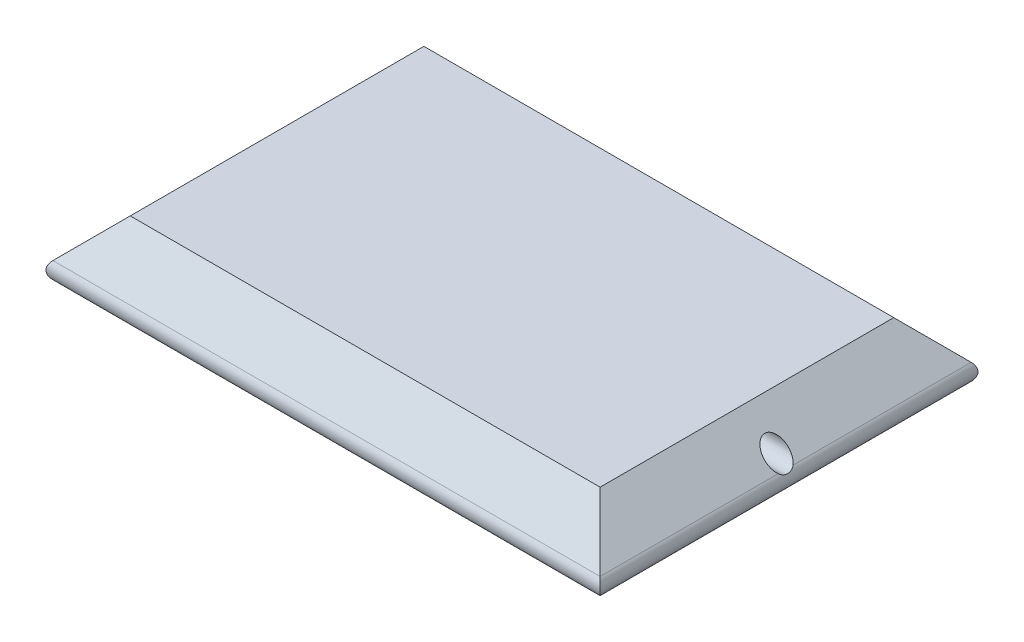
ISO-10303-21;
HEADER;
FILE_DESCRIPTION(('STEP AP214'),'2;1');
FILE_NAME('part.step','',(''),(''),'','','');
FILE_SCHEMA(('AUTOMOTIVE_DESIGN { 1 0 10303 214 1 1 1 1 }'));
ENDSEC;
DATA;
#1=APPLICATION_CONTEXT('core data for automotive mechanical design processes');
#2=APPLICATION_PROTOCOL_DEFINITION('international standard','automotive_design',2000,#1);
#3=PRODUCT_CONTEXT('',#1,'mechanical');
#4=PRODUCT('Part','Part','',(#3));
#5=PRODUCT_RELATED_PRODUCT_CATEGORY('part','',(#4));
#6=PRODUCT_DEFINITION_FORMATION('','',#4);
#7=PRODUCT_DEFINITION_CONTEXT('part definition',#1,'design');
#8=PRODUCT_DEFINITION('design','',#6,#7);
#9=PRODUCT_DEFINITION_SHAPE('','',#8);
#10=(LENGTH_UNIT() NAMED_UNIT(*) SI_UNIT(.MILLI.,.METRE.));
#11=(NAMED_UNIT(*) PLANE_ANGLE_UNIT() SI_UNIT($,.RADIAN.));
#12=(NAMED_UNIT(*) SI_UNIT($,.STERADIAN.) SOLID_ANGLE_UNIT());
#13=UNCERTAINTY_MEASURE_WITH_UNIT(LENGTH_MEASURE(1.E-05),#10,'distance_accuracy_value','');
#14=(GEOMETRIC_REPRESENTATION_CONTEXT(3) GLOBAL_UNCERTAINTY_ASSIGNED_CONTEXT((#13)) GLOBAL_UNIT_ASSIGNED_CONTEXT((#10,
#11,#12)) REPRESENTATION_CONTEXT('',''));
#15=CARTESIAN_POINT('',(0.,0.,0.));
#16=DIRECTION('',(0.,0.,1.));
#17=DIRECTION('',(1.,0.,0.));
#18=AXIS2_PLACEMENT_3D('',#15,#16,#17);
#19=CARTESIAN_POINT('',(50.,0.,-35.));
#20=DIRECTION('',(0.707106781186546,0.707106781186549,0.));
#21=DIRECTION('',(-0.707106781186549,0.707106781186546,0.));
#22=AXIS2_PLACEMENT_3D('',#19,#20,#21);
#23=PLANE('',#22);
#24=DIRECTION('',(0.577350269189627,-0.577350269189624,0.577350269189627));
#25=VECTOR('',#24,1.);
#26=CARTESIAN_POINT('',(26.6666666666666,23.3333333333333,11.6666666666666));
#27=LINE('',#26,#25);
#28=CARTESIAN_POINT('',(40.,10.,25.));
#29=VERTEX_POINT('',#28);
#30=CARTESIAN_POINT('',(46.5857864376269,3.4142135623731,31.5857864376269));
#31=VERTEX_POINT('',#30);
#32=EDGE_CURVE('E125',#29,#31,#27,.T.);
#33=ORIENTED_EDGE('',*,*,#32,.T.);
#34=DIRECTION('',(0.,0.,-1.));
#35=VECTOR('',#34,1.);
#36=CARTESIAN_POINT('',(46.5857864376269,3.4142135623731,-35.));
#37=LINE('',#36,#35);
#38=CARTESIAN_POINT('',(46.5857864376269,3.4142135623731,1.26719800951588));
#39=VERTEX_POINT('',#38);
#40=EDGE_CURVE('E44',#31,#39,#37,.T.);
#41=ORIENTED_EDGE('',*,*,#40,.T.);
#42=CARTESIAN_POINT('',(45.0384631990374,4.96153680096256,0.));
#43=DIRECTION('',(0.707106781186546,0.707106781186549,0.));
#44=DIRECTION('',(0.707106781186549,-0.707106781186546,0.));
#45=AXIS2_PLACEMENT_3D('',#42,#43,#44);
#46=ELLIPSE('',#45,2.8284271247462,2.);
#47=CARTESIAN_POINT('',(46.5857864376269,3.4142135623731,-1.26719800951589));
#48=VERTEX_POINT('',#47);
#49=EDGE_CURVE('E112',#39,#48,#46,.F.);
#50=ORIENTED_EDGE('',*,*,#49,.T.);
#51=DIRECTION('',(0.,0.,-1.));
#52=VECTOR('',#51,1.);
#53=CARTESIAN_POINT('',(46.5857864376269,3.4142135623731,-35.));
#54=LINE('',#53,#52);
#55=CARTESIAN_POINT('',(46.5857864376269,3.4142135623731,-31.5857864376269));
#56=VERTEX_POINT('',#55);
#57=EDGE_CURVE('E115',#48,#56,#54,.T.);
#58=ORIENTED_EDGE('',*,*,#57,.T.);
#59=DIRECTION('',(0.577350269189626,-0.577350269189624,-0.577350269189627));
#60=VECTOR('',#59,1.);
#61=CARTESIAN_POINT('',(16.6666666666666,33.3333333333333,-1.66666666666659));
#62=LINE('',#61,#60);
#63=CARTESIAN_POINT('',(40.,10.,-25.));
#64=VERTEX_POINT('',#63);
#65=EDGE_CURVE('E98',#64,#56,#62,.T.);
#66=ORIENTED_EDGE('',*,*,#65,.F.);
#67=DIRECTION('',(0.,0.,1.));
#68=VECTOR('',#67,1.);
#69=CARTESIAN_POINT('',(40.,10.,-35.));
#70=LINE('',#69,#68);
#71=EDGE_CURVE('E105',#29,#64,#70,.F.);
#72=ORIENTED_EDGE('',*,*,#71,.F.);
#73=EDGE_LOOP('',(#33,#41,#50,#58,#66,#72));
#74=FACE_BOUND('',#73,.T.);
#75=ADVANCED_FACE('F34',(#74),#23,.T.);
#76=CARTESIAN_POINT('',(-50.,0.,-35.));
#77=DIRECTION('',(0.,0.707106781186549,-0.707106781186546));
#78=DIRECTION('',(0.,0.707106781186546,0.707106781186549));
#79=AXIS2_PLACEMENT_3D('',#76,#77,#78);
#80=PLANE('',#79);
#81=ORIENTED_EDGE('',*,*,#65,.T.);
#82=DIRECTION('',(-1.,0.,0.));
#83=VECTOR('',#82,1.);
#84=CARTESIAN_POINT('',(-50.,3.41421356237309,-31.5857864376269));
#85=LINE('',#84,#83);
#86=CARTESIAN_POINT('',(-46.5857864376269,3.4142135623731,-31.5857864376269));
#87=VERTEX_POINT('',#86);
#88=EDGE_CURVE('E170',#56,#87,#85,.T.);
#89=ORIENTED_EDGE('',*,*,#88,.T.);
#90=DIRECTION('',(-0.577350269189627,-0.577350269189624,-0.577350269189627));
#91=VECTOR('',#90,1.);
#92=CARTESIAN_POINT('',(-50.,0.,-35.));
#93=LINE('',#92,#91);
#94=CARTESIAN_POINT('',(-40.,10.,-25.));
#95=VERTEX_POINT('',#94);
#96=EDGE_CURVE('E101',#95,#87,#93,.T.);
#97=ORIENTED_EDGE('',*,*,#96,.F.);
#98=DIRECTION('',(1.,0.,0.));
#99=VECTOR('',#98,1.);
#100=CARTESIAN_POINT('',(-50.,10.,-25.));
#101=LINE('',#100,#99);
#102=EDGE_CURVE('E94',#64,#95,#101,.F.);
#103=ORIENTED_EDGE('',*,*,#102,.F.);
#104=EDGE_LOOP('',(#81,#89,#97,#103));
#105=FACE_BOUND('',#104,.T.);
#106=ADVANCED_FACE('F96',(#105),#80,.T.);
#107=CARTESIAN_POINT('',(-50.,0.,-35.));
#108=DIRECTION('',(-0.707106781186546,0.707106781186549,0.));
#109=DIRECTION('',(-0.707106781186549,-0.707106781186546,0.));
#110=AXIS2_PLACEMENT_3D('',#107,#108,#109);
#111=PLANE('',#110);
#112=ORIENTED_EDGE('',*,*,#96,.T.);
#113=DIRECTION('',(0.,0.,1.));
#114=VECTOR('',#113,1.);
#115=CARTESIAN_POINT('',(-46.5857864376269,3.4142135623731,-35.));
#116=LINE('',#115,#114);
#117=CARTESIAN_POINT('',(-46.5857864376269,3.4142135623731,31.5857864376269));
#118=VERTEX_POINT('',#117);
#119=EDGE_CURVE('E116',#87,#118,#116,.T.);
#120=ORIENTED_EDGE('',*,*,#119,.T.);
#121=DIRECTION('',(-0.577350269189626,-0.577350269189624,0.577350269189627));
#122=VECTOR('',#121,1.);
#123=CARTESIAN_POINT('',(-50.,0.,35.));
#124=LINE('',#123,#122);
#125=CARTESIAN_POINT('',(-40.,10.,25.));
#126=VERTEX_POINT('',#125);
#127=EDGE_CURVE('E121',#126,#118,#124,.T.);
#128=ORIENTED_EDGE('',*,*,#127,.F.);
#129=DIRECTION('',(0.,0.,-1.));
#130=VECTOR('',#129,1.);
#131=CARTESIAN_POINT('',(-40.,10.,-35.));
#132=LINE('',#131,#130);
#133=EDGE_CURVE('E104',#95,#126,#132,.F.);
#134=ORIENTED_EDGE('',*,*,#133,.F.);
#135=EDGE_LOOP('',(#112,#120,#128,#134));
#136=FACE_BOUND('',#135,.T.);
#137=ADVANCED_FACE('F183',(#136),#111,.T.);
#138=CARTESIAN_POINT('',(-50.,0.,35.));
#139=DIRECTION('',(0.,0.707106781186549,0.707106781186546));
#140=DIRECTION('',(0.,-0.707106781186546,0.707106781186549));
#141=AXIS2_PLACEMENT_3D('',#138,#139,#140);
#142=PLANE('',#141);
#143=ORIENTED_EDGE('',*,*,#127,.T.);
#144=DIRECTION('',(1.,0.,0.));
#145=VECTOR('',#144,1.);
#146=CARTESIAN_POINT('',(-50.,3.41421356237309,31.5857864376269));
#147=LINE('',#146,#145);
#148=EDGE_CURVE('E180',#118,#31,#147,.T.);
#149=ORIENTED_EDGE('',*,*,#148,.T.);
#150=ORIENTED_EDGE('',*,*,#32,.F.);
#151=DIRECTION('',(-1.,0.,0.));
#152=VECTOR('',#151,1.);
#153=CARTESIAN_POINT('',(-50.,10.,25.));
#154=LINE('',#153,#152);
#155=EDGE_CURVE('E110',#126,#29,#154,.F.);
#156=ORIENTED_EDGE('',*,*,#155,.F.);
#157=EDGE_LOOP('',(#143,#149,#150,#156));
#158=FACE_BOUND('',#157,.T.);
#159=ADVANCED_FACE('F192',(#158),#142,.T.);
#160=CARTESIAN_POINT('',(50.,10.,35.));
#161=DIRECTION('',(0.,1.,0.));
#162=DIRECTION('',(0.,0.,1.));
#163=AXIS2_PLACEMENT_3D('',#160,#161,#162);
#164=PLANE('',#163);
#165=ORIENTED_EDGE('',*,*,#71,.T.);
#166=ORIENTED_EDGE('',*,*,#102,.T.);
#167=ORIENTED_EDGE('',*,*,#133,.T.);
#168=ORIENTED_EDGE('',*,*,#155,.T.);
#169=EDGE_LOOP('',(#165,#166,#167,#168));
#170=FACE_BOUND('',#169,.T.);
#171=ADVANCED_FACE('F108',(#170),#164,.T.);
#172=CARTESIAN_POINT('',(50.,0.,35.));
#173=DIRECTION('',(0.,1.,0.));
#174=DIRECTION('',(0.,0.,1.));
#175=AXIS2_PLACEMENT_3D('',#172,#173,#174);
#176=PLANE('',#175);
#177=DIRECTION('',(-1.,0.,0.));
#178=VECTOR('',#177,1.);
#179=CARTESIAN_POINT('',(50.,0.,30.1715728752538));
#180=LINE('',#179,#178);
#181=CARTESIAN_POINT('',(45.1715728752538,0.,30.1715728752538));
#182=VERTEX_POINT('',#181);
#183=CARTESIAN_POINT('',(-45.1715728752538,0.,30.1715728752538));
#184=VERTEX_POINT('',#183);
#185=EDGE_CURVE('E174',#182,#184,#180,.T.);
#186=ORIENTED_EDGE('',*,*,#185,.T.);
#187=DIRECTION('',(0.,0.,-1.));
#188=VECTOR('',#187,1.);
#189=CARTESIAN_POINT('',(-45.1715728752538,0.,35.));
#190=LINE('',#189,#188);
#191=CARTESIAN_POINT('',(-45.1715728752538,0.,-30.1715728752538));
#192=VERTEX_POINT('',#191);
#193=EDGE_CURVE('E178',#184,#192,#190,.T.);
#194=ORIENTED_EDGE('',*,*,#193,.T.);
#195=DIRECTION('',(1.,0.,0.));
#196=VECTOR('',#195,1.);
#197=CARTESIAN_POINT('',(50.,0.,-30.1715728752538));
#198=LINE('',#197,#196);
#199=CARTESIAN_POINT('',(45.1715728752538,0.,-30.1715728752538));
#200=VERTEX_POINT('',#199);
#201=EDGE_CURVE('E168',#192,#200,#198,.T.);
#202=ORIENTED_EDGE('',*,*,#201,.T.);
#203=DIRECTION('',(0.,0.,1.));
#204=VECTOR('',#203,1.);
#205=CARTESIAN_POINT('',(45.1715728752538,0.,35.));
#206=LINE('',#205,#204);
#207=EDGE_CURVE('E119',#200,#182,#206,.T.);
#208=ORIENTED_EDGE('',*,*,#207,.T.);
#209=EDGE_LOOP('',(#186,#194,#202,#208));
#210=FACE_BOUND('',#209,.T.);
#211=ADVANCED_FACE('F144',(#210),#176,.F.);
#212=CARTESIAN_POINT('',(54.7999003943573,4.96153680096256,0.));
#213=DIRECTION('',(1.,0.,0.));
#214=DIRECTION('',(0.,0.,-1.));
#215=AXIS2_PLACEMENT_3D('',#212,#213,#214);
#216=CYLINDRICAL_SURFACE('',#215,2.);
#217=CARTESIAN_POINT('',(28.9336134010088,3.57052206354669,-1.43703792583629));
#218=CARTESIAN_POINT('',(28.9302500842993,3.65129543883444,-1.51521745408679));
#219=CARTESIAN_POINT('',(28.9266046364787,3.73872841691853,-1.58662283919386));
#220=CARTESIAN_POINT('',(28.9188492143297,3.92440671010233,-1.71378291492151));
#221=CARTESIAN_POINT('',(28.9147386810685,4.0226650311359,-1.76951848750102));
#222=CARTESIAN_POINT('',(28.9061700946232,4.22709404026815,-1.86366448216789));
#223=CARTESIAN_POINT('',(28.901712219434,4.33326067455105,-1.90208371039462));
#224=CARTESIAN_POINT('',(28.8925719148953,4.55049951944075,-1.96053556152479));
#225=CARTESIAN_POINT('',(28.8878895417147,4.66157050244565,-1.98057275857346));
#226=CARTESIAN_POINT('',(28.8784270811186,4.88556330780471,-2.00172171529807));
#227=CARTESIAN_POINT('',(28.8736469372803,4.99848619097791,-2.00282221946603));
#228=CARTESIAN_POINT('',(28.8641267534127,5.22291824040703,-1.98603710573411));
#229=CARTESIAN_POINT('',(28.8593867150624,5.33442734756919,-1.96815069683955));
#230=CARTESIAN_POINT('',(28.8500818354507,5.5528851991357,-1.91389042322263));
#231=CARTESIAN_POINT('',(28.8455170301586,5.65983300775362,-1.877512784466));
#232=CARTESIAN_POINT('',(28.8366962551669,5.86610492375948,-1.78729634302412));
#233=CARTESIAN_POINT('',(28.8324402845127,5.96542905471073,-1.73345759431043));
#234=CARTESIAN_POINT('',(28.8243638460767,6.15359465370042,-1.609864575542));
#235=CARTESIAN_POINT('',(28.8205432242379,6.24243983032392,-1.54011596191009));
#236=CARTESIAN_POINT('',(28.8134495064099,6.40715787968875,-1.38666832942729));
#237=CARTESIAN_POINT('',(28.810176407266,6.48303082717353,-1.30296939096094));
#238=CARTESIAN_POINT('',(28.8042786396863,6.61958542060458,-1.124067603232));
#239=CARTESIAN_POINT('',(28.8016534562807,6.68027913167098,-1.02887398026847));
#240=CARTESIAN_POINT('',(28.7971278304592,6.78482173011614,-0.829631572694957));
#241=CARTESIAN_POINT('',(28.7952273851374,6.82867068503727,-0.725582823593388));
#242=CARTESIAN_POINT('',(28.7922107111101,6.89823952610122,-0.511683138208238));
#243=CARTESIAN_POINT('',(28.7910937878604,6.92397546838371,-0.401837433694882));
#244=CARTESIAN_POINT('',(28.7896757077305,6.95664618039834,-0.179379786301296));
#245=CARTESIAN_POINT('',(28.7893745473681,6.9635810303819,-0.0667678552306202));
#246=CARTESIAN_POINT('',(28.7895971903318,6.95845299191555,0.157957549142505));
#247=CARTESIAN_POINT('',(28.7901205256039,6.94640088208121,0.270071269045188));
#248=CARTESIAN_POINT('',(28.7919751991576,6.90366323803358,0.490681956415258));
#249=CARTESIAN_POINT('',(28.7933065368756,6.87297771681809,0.599178926405466));
#250=CARTESIAN_POINT('',(28.7967364750375,6.79384791227425,0.809480279750411));
#251=CARTESIAN_POINT('',(28.7988350905166,6.74540328094492,0.911284531911007));
#252=CARTESIAN_POINT('',(28.8037356774942,6.63213567173818,1.10531387640264));
#253=CARTESIAN_POINT('',(28.8065376507615,6.56731265267111,1.19753894464236));
#254=CARTESIAN_POINT('',(28.8127622043288,6.4230888906269,1.36985259241322));
#255=CARTESIAN_POINT('',(28.8161851541553,6.34367946731454,1.44993389313674));
#256=CARTESIAN_POINT('',(28.8235480992731,6.17256568790846,1.59563030667392));
#257=CARTESIAN_POINT('',(28.8274880970227,6.08086127335717,1.6612453507026));
#258=CARTESIAN_POINT('',(28.8357722970203,5.88767281748863,1.77620885236815));
#259=CARTESIAN_POINT('',(28.8401168571581,5.78618011422913,1.82554272844082));
#260=CARTESIAN_POINT('',(28.8490800581338,5.57636404369196,1.90647073863324));
#261=CARTESIAN_POINT('',(28.853698700219,5.46804064533005,1.93806479201843));
#262=CARTESIAN_POINT('',(28.8630803178297,5.24754730848134,1.98263935514687));
#263=CARTESIAN_POINT('',(28.8678434030529,5.13537443753952,1.995605336961));
#264=CARTESIAN_POINT('',(28.8773744359795,4.91044457538369,2.00251091498559));
#265=CARTESIAN_POINT('',(28.8821423836974,4.79768758242021,1.99645045417826));
#266=CARTESIAN_POINT('',(28.8915501862129,4.57475202481605,1.96546855120156));
#267=CARTESIAN_POINT('',(28.8961899988633,4.46457431034331,1.94054097794203));
#268=CARTESIAN_POINT('',(28.905210449894,4.24996500959158,1.87252142506877));
#269=CARTESIAN_POINT('',(28.9095910886899,4.14553341409479,1.82942947459489));
#270=CARTESIAN_POINT('',(28.9179711778401,3.94541121598183,1.72631284331077));
#271=CARTESIAN_POINT('',(28.9219707251916,3.84971838939029,1.66629248668675));
#272=CARTESIAN_POINT('',(28.9294805228838,3.66976729539411,1.53101342995237));
#273=CARTESIAN_POINT('',(28.9329907739732,3.58550901049473,1.45575475315693));
#274=CARTESIAN_POINT('',(28.9394244476922,3.43088397757841,1.29219135536171));
#275=CARTESIAN_POINT('',(28.9423482833427,3.36050745301531,1.20389589299863));
#276=CARTESIAN_POINT('',(28.9475334964771,3.23557860163033,1.01672425917693));
#277=CARTESIAN_POINT('',(28.9497948756967,3.18102623334427,0.917848115443909));
#278=CARTESIAN_POINT('',(28.953593009288,3.08934166041698,0.712409845107325));
#279=CARTESIAN_POINT('',(28.955130359993,3.05219511990385,0.605854127356164));
#280=CARTESIAN_POINT('',(28.9574421544668,2.99631741518437,0.388015350695642));
#281=CARTESIAN_POINT('',(28.9582166312724,2.97758545352455,0.276732496715263));
#282=CARTESIAN_POINT('',(28.9589819345558,2.95907544298533,0.0526817527528011));
#283=CARTESIAN_POINT('',(28.9589733342427,2.95928353007233,-0.0600849905717542));
#284=CARTESIAN_POINT('',(28.9581739383061,2.97861797137815,-0.284012857905234));
#285=CARTESIAN_POINT('',(28.9573829493186,2.99774900232125,-0.395173578101715));
#286=CARTESIAN_POINT('',(28.9550395235412,3.05439007395855,-0.612728154826484));
#287=CARTESIAN_POINT('',(28.9534868401976,3.0919060656961,-0.719120455682129));
#288=CARTESIAN_POINT('',(28.9496621405355,3.18422873717369,-0.923997752749973));
#289=CARTESIAN_POINT('',(28.9473909917157,3.23901456446609,-1.02249210635807));
#290=CARTESIAN_POINT('',(28.9431723209012,3.340651951031,-1.17373111293809));
#291=CARTESIAN_POINT('',(28.9414244976432,3.38273426925383,-1.22974684800935));
#292=CARTESIAN_POINT('',(28.9376920374299,3.47252459200413,-1.33706298463219));
#293=CARTESIAN_POINT('',(28.9357074004894,3.5202325961813,-1.38836338647738));
#294=CARTESIAN_POINT('',(28.9336134010088,3.57052206354669,-1.43703792583629));
#295=B_SPLINE_CURVE_WITH_KNOTS('',3,(#217,#218,#219,#220,#221,#222,#223,#224,#225,#226,#227,
#228,#229,#230,#231,#232,#233,#234,#235,#236,#237,#238,#239,#240,#241,#242,#243,#244,#245,#246,
#247,#248,#249,#250,#251,#252,#253,#254,#255,#256,#257,#258,#259,#260,#261,#262,#263,#264,#265,
#266,#267,#268,#269,#270,#271,#272,#273,#274,#275,#276,#277,#278,#279,#280,#281,#282,#283,#284,
#285,#286,#287,#288,#289,#290,#291,#292,#293,#294),.UNSPECIFIED.,.T.,.F.,(4,2,2,2,2,2,2,2,2,2,2,
2,2,2,2,2,2,2,2,2,2,2,2,2,2,2,2,2,2,2,2,2,2,2,2,2,2,2,4),(0.,0.337130005245633,
0.674669560319044,1.01203726714496,1.34932100132486,1.68680520180278,2.02430346242223,
2.36187063364145,2.69943676146459,3.03688306118899,3.37432741654814,3.71150269781231,
4.04867662709161,4.38555129341986,4.722424521815,5.05910658117361,5.39578840567878,
5.73247682802976,6.06916609711996,6.40605638218564,6.74294826908173,7.08014106577848,
7.41733539703935,7.75479256179002,8.0922507378218,8.42981862196553,8.7673859645748,
9.10486715707186,9.44234783322005,9.7795899755642,10.1168312342215,10.4537942422464,
10.7907426572599,11.1274444294788,11.464229436892,11.8011235306041,12.1376123900225,
12.3475093937319,12.5574063843714),.UNSPECIFIED.);
#296=CARTESIAN_POINT('',(28.9336134010088,3.57052206354669,-1.43703792583629));
#297=VERTEX_POINT('',#296);
#298=EDGE_CURVE('E131',#297,#297,#295,.T.);
#299=ORIENTED_EDGE('',*,*,#298,.F.);
#300=EDGE_LOOP('',(#299));
#301=FACE_BOUND('',#300,.T.);
#302=ORIENTED_EDGE('',*,*,#49,.F.);
#303=CARTESIAN_POINT('',(46.5857864376269,3.4142135623731,1.26719800951589));
#304=CARTESIAN_POINT('',(46.6101210865403,3.38988257202771,1.23750906087224));
#305=CARTESIAN_POINT('',(46.6329248179384,3.36581941189452,1.20636234338305));
#306=CARTESIAN_POINT('',(46.6755511549119,3.31873207327676,1.14139712402252));
#307=CARTESIAN_POINT('',(46.695375592511,3.29570726243962,1.10758028373857));
#308=CARTESIAN_POINT('',(46.7320681599295,3.25127248508068,1.0376447167542));
#309=CARTESIAN_POINT('',(46.7489496380723,3.22985549215494,1.0015374534908));
#310=CARTESIAN_POINT('',(46.7800275325229,3.18892067923186,0.927166650131125));
#311=CARTESIAN_POINT('',(46.7942236846235,3.16940304620269,0.888902898339856));
#312=CARTESIAN_POINT('',(46.8330172196089,3.1142858496672,0.771430847690939));
#313=CARTESIAN_POINT('',(46.8539061832224,3.08201166059544,0.689370906083631));
#314=CARTESIAN_POINT('',(46.8872578950182,3.02831330288615,0.520152914523974));
#315=CARTESIAN_POINT('',(46.8997129861937,3.00689899821694,0.432990309704785));
#316=CARTESIAN_POINT('',(46.917728700661,2.97533926257689,0.252449935702014));
#317=CARTESIAN_POINT('',(46.9230053128386,2.96565960971012,0.15896208659198));
#318=CARTESIAN_POINT('',(46.9263649032782,2.95953908015816,-0.0285926400486429));
#319=CARTESIAN_POINT('',(46.9244454079707,2.96310275569319,-0.122659705582952));
#320=CARTESIAN_POINT('',(46.9129168337608,2.98380553208749,-0.313377770955261));
#321=CARTESIAN_POINT('',(46.9029466429015,3.00158175588158,-0.409939110055912));
#322=CARTESIAN_POINT('',(46.8736439212425,3.05060164588715,-0.598132846120731));
#323=CARTESIAN_POINT('',(46.8543131552884,3.08184277329965,-0.689766168597671));
#324=CARTESIAN_POINT('',(46.8072952374457,3.15150325089792,-0.854910727337348));
#325=CARTESIAN_POINT('',(46.7808251984673,3.18868340396272,-0.929294042161544));
#326=CARTESIAN_POINT('',(46.7177410065469,3.26963347633977,-1.06957089033061));
#327=CARTESIAN_POINT('',(46.681153451242,3.31338598189155,-1.1354860289532));
#328=CARTESIAN_POINT('',(46.6307014428278,3.36788149339527,-1.20851173976106));
#329=CARTESIAN_POINT('',(46.6220247380892,3.37708192658367,-1.22054512351373));
#330=CARTESIAN_POINT('',(46.6042351561201,3.39557976172062,-1.24418706858244));
#331=CARTESIAN_POINT('',(46.5951226361488,3.40487707951862,-1.25579596454894));
#332=CARTESIAN_POINT('',(46.5857864376274,3.41421356237307,-1.26719800951624));
#333=B_SPLINE_CURVE_WITH_KNOTS('',3,(#303,#304,#305,#306,#307,#308,#309,#310,#311,#312,#313,
#314,#315,#316,#317,#318,#319,#320,#321,#322,#323,#324,#325,#326,#327,#328,#329,#330,#331,#332),
.UNSPECIFIED.,.F.,.F.,(4,2,2,2,2,2,2,2,2,2,2,2,2,2,4),(0.,0.136282004205321,0.272479860101512,
0.408042914639109,0.543619300189749,0.814117720748619,1.08486139533263,1.36603258109168,
1.64730042469172,1.9419355194815,2.23651508529847,2.49720697666327,2.75721995342431,
2.80958462456196,2.86190708190916),.UNSPECIFIED.);
#334=EDGE_CURVE('E11',#39,#48,#333,.T.);
#335=ORIENTED_EDGE('',*,*,#334,.T.);
#336=EDGE_LOOP('',(#302,#335));
#337=FACE_BOUND('',#336,.T.);
#338=ADVANCED_FACE('F141',(#301,#337),#216,.F.);
#339=CARTESIAN_POINT('',(25.4142079542135,4.81499275455377,0.));
#340=DIRECTION('',(1.,0.,0.));
#341=DIRECTION('',(0.,-1.,0.));
#342=AXIS2_PLACEMENT_3D('',#339,#340,#341);
#343=SPHERICAL_SURFACE('',#342,4.);
#344=ORIENTED_EDGE('',*,*,#298,.T.);
#345=EDGE_LOOP('',(#344));
#346=FACE_BOUND('',#345,.T.);
#347=ADVANCED_FACE('F138',(#346),#343,.F.);
#348=CARTESIAN_POINT('',(45.1715728752538,2.,-35.));
#349=DIRECTION('',(0.,0.,1.));
#350=DIRECTION('',(1.,0.,0.));
#351=AXIS2_PLACEMENT_3D('',#348,#349,#350);
#352=CYLINDRICAL_SURFACE('',#351,2.);
#353=CARTESIAN_POINT('',(45.1715728752538,2.,30.1715728752538));
#354=DIRECTION('',(-0.707106781186547,0.,0.707106781186548));
#355=DIRECTION('',(0.707106781186547,0.,0.707106781186547));
#356=AXIS2_PLACEMENT_3D('',#353,#354,#355);
#357=ELLIPSE('',#356,2.82842712474619,2.);
#358=EDGE_CURVE('E156',#182,#31,#357,.T.);
#359=ORIENTED_EDGE('',*,*,#358,.F.);
#360=ORIENTED_EDGE('',*,*,#207,.F.);
#361=CARTESIAN_POINT('',(45.1715728752538,2.,-30.1715728752538));
#362=DIRECTION('',(0.707106781186547,0.,0.707106781186547));
#363=DIRECTION('',(-0.707106781186547,0.,0.707106781186548));
#364=AXIS2_PLACEMENT_3D('',#361,#362,#363);
#365=ELLIPSE('',#364,2.82842712474619,2.);
#366=EDGE_CURVE('E39',#56,#200,#365,.F.);
#367=ORIENTED_EDGE('',*,*,#366,.F.);
#368=ORIENTED_EDGE('',*,*,#57,.F.);
#369=ORIENTED_EDGE('',*,*,#334,.F.);
#370=ORIENTED_EDGE('',*,*,#40,.F.);
#371=EDGE_LOOP('',(#359,#360,#367,#368,#369,#370));
#372=FACE_BOUND('',#371,.T.);
#373=ADVANCED_FACE('F36',(#372),#352,.T.);
#374=CARTESIAN_POINT('',(-50.,2.,-30.1715728752538));
#375=DIRECTION('',(1.,0.,0.));
#376=DIRECTION('',(0.,0.,-1.));
#377=AXIS2_PLACEMENT_3D('',#374,#375,#376);
#378=CYLINDRICAL_SURFACE('',#377,2.);
#379=ORIENTED_EDGE('',*,*,#366,.T.);
#380=ORIENTED_EDGE('',*,*,#201,.F.);
#381=CARTESIAN_POINT('',(-45.1715728752538,2.,-30.1715728752538));
#382=DIRECTION('',(0.707106781186547,0.,-0.707106781186548));
#383=DIRECTION('',(0.707106781186548,0.,0.707106781186547));
#384=AXIS2_PLACEMENT_3D('',#381,#382,#383);
#385=ELLIPSE('',#384,2.82842712474619,2.);
#386=EDGE_CURVE('E155',#87,#192,#385,.F.);
#387=ORIENTED_EDGE('',*,*,#386,.F.);
#388=ORIENTED_EDGE('',*,*,#88,.F.);
#389=EDGE_LOOP('',(#379,#380,#387,#388));
#390=FACE_BOUND('',#389,.T.);
#391=ADVANCED_FACE('F166',(#390),#378,.T.);
#392=CARTESIAN_POINT('',(-50.,2.,30.1715728752538));
#393=DIRECTION('',(-1.,0.,0.));
#394=DIRECTION('',(0.,0.,1.));
#395=AXIS2_PLACEMENT_3D('',#392,#393,#394);
#396=CYLINDRICAL_SURFACE('',#395,2.);
#397=ORIENTED_EDGE('',*,*,#358,.T.);
#398=ORIENTED_EDGE('',*,*,#148,.F.);
#399=CARTESIAN_POINT('',(-45.1715728752538,2.,30.1715728752538));
#400=DIRECTION('',(-0.707106781186548,0.,-0.707106781186547));
#401=DIRECTION('',(-0.707106781186547,0.,0.707106781186548));
#402=AXIS2_PLACEMENT_3D('',#399,#400,#401);
#403=ELLIPSE('',#402,2.82842712474619,2.);
#404=EDGE_CURVE('E153',#184,#118,#403,.T.);
#405=ORIENTED_EDGE('',*,*,#404,.F.);
#406=ORIENTED_EDGE('',*,*,#185,.F.);
#407=EDGE_LOOP('',(#397,#398,#405,#406));
#408=FACE_BOUND('',#407,.T.);
#409=ADVANCED_FACE('F190',(#408),#396,.T.);
#410=CARTESIAN_POINT('',(-45.1715728752538,2.,-35.));
#411=DIRECTION('',(0.,0.,-1.));
#412=DIRECTION('',(-1.,0.,0.));
#413=AXIS2_PLACEMENT_3D('',#410,#411,#412);
#414=CYLINDRICAL_SURFACE('',#413,2.);
#415=ORIENTED_EDGE('',*,*,#386,.T.);
#416=ORIENTED_EDGE('',*,*,#193,.F.);
#417=ORIENTED_EDGE('',*,*,#404,.T.);
#418=ORIENTED_EDGE('',*,*,#119,.F.);
#419=EDGE_LOOP('',(#415,#416,#417,#418));
#420=FACE_BOUND('',#419,.T.);
#421=ADVANCED_FACE('F188',(#420),#414,.T.);
#422=CLOSED_SHELL('',(#75,#106,#137,#159,#171,#211,#338,#347,#373,#391,#409,#421));
#423=MANIFOLD_SOLID_BREP('B2',#422);
#424=ADVANCED_BREP_SHAPE_REPRESENTATION('',(#18,#423),#14);
#425=SHAPE_DEFINITION_REPRESENTATION(#9,#424);
ENDSEC;
END-ISO-10303-21;
